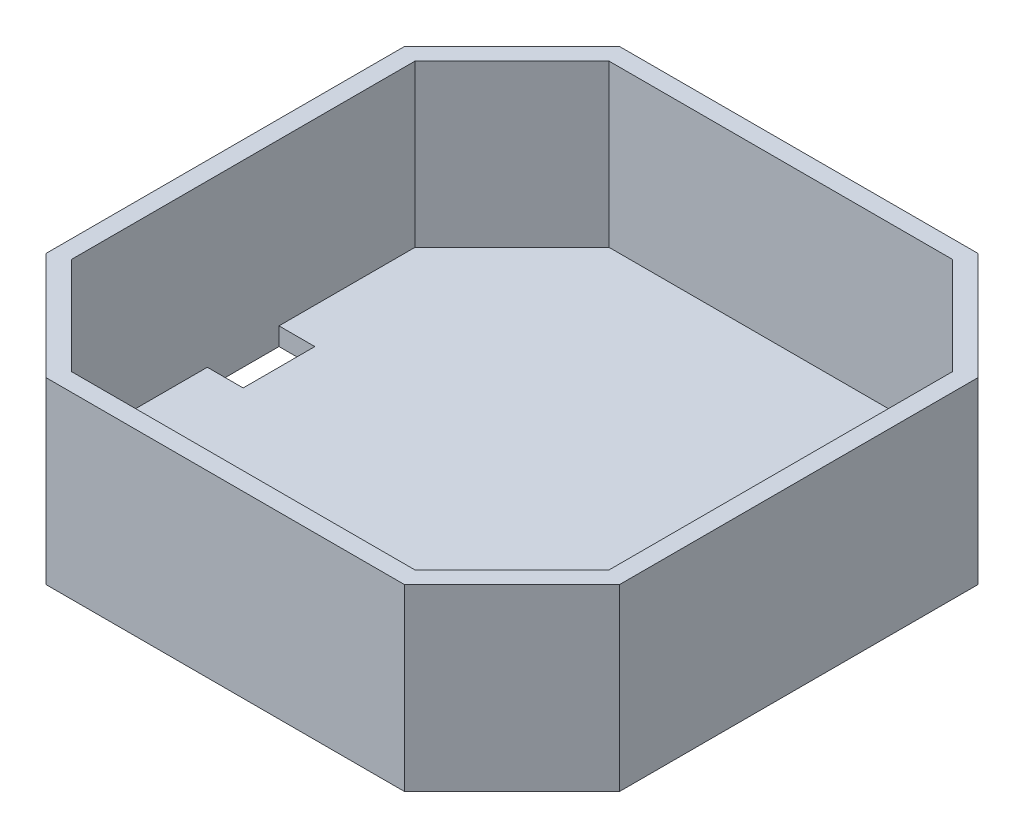
ISO-10303-21;
HEADER;
FILE_DESCRIPTION(('STEP AP214'),'2;1');
FILE_NAME('part.step','',(''),(''),'','','');
FILE_SCHEMA(('AUTOMOTIVE_DESIGN { 1 0 10303 214 1 1 1 1 }'));
ENDSEC;
DATA;
#1=APPLICATION_CONTEXT('core data for automotive mechanical design processes');
#2=APPLICATION_PROTOCOL_DEFINITION('international standard','automotive_design',2000,#1);
#3=PRODUCT_CONTEXT('',#1,'mechanical');
#4=PRODUCT('Part','Part','',(#3));
#5=PRODUCT_RELATED_PRODUCT_CATEGORY('part','',(#4));
#6=PRODUCT_DEFINITION_FORMATION('','',#4);
#7=PRODUCT_DEFINITION_CONTEXT('part definition',#1,'design');
#8=PRODUCT_DEFINITION('design','',#6,#7);
#9=PRODUCT_DEFINITION_SHAPE('','',#8);
#10=(LENGTH_UNIT() NAMED_UNIT(*) SI_UNIT(.MILLI.,.METRE.));
#11=(NAMED_UNIT(*) PLANE_ANGLE_UNIT() SI_UNIT($,.RADIAN.));
#12=(NAMED_UNIT(*) SI_UNIT($,.STERADIAN.) SOLID_ANGLE_UNIT());
#13=UNCERTAINTY_MEASURE_WITH_UNIT(LENGTH_MEASURE(1.E-05),#10,'distance_accuracy_value','');
#14=(GEOMETRIC_REPRESENTATION_CONTEXT(3) GLOBAL_UNCERTAINTY_ASSIGNED_CONTEXT((#13)) GLOBAL_UNIT_ASSIGNED_CONTEXT((#10,
#11,#12)) REPRESENTATION_CONTEXT('',''));
#15=CARTESIAN_POINT('',(0.,0.,0.));
#16=DIRECTION('',(0.,0.,1.));
#17=DIRECTION('',(1.,0.,0.));
#18=AXIS2_PLACEMENT_3D('',#15,#16,#17);
#19=CARTESIAN_POINT('',(0.,50.,0.));
#20=DIRECTION('',(0.,1.,0.));
#21=DIRECTION('',(0.,0.,1.));
#22=AXIS2_PLACEMENT_3D('',#19,#20,#21);
#23=PLANE('',#22);
#24=DIRECTION('',(-0.707106781186551,0.,-0.707106781186544));
#25=VECTOR('',#24,1.);
#26=CARTESIAN_POINT('',(-64.9999999999997,50.,65.0000000000004));
#27=LINE('',#26,#25);
#28=CARTESIAN_POINT('',(-50.,50.,80.));
#29=VERTEX_POINT('',#28);
#30=CARTESIAN_POINT('',(-80.,50.,50.0000000000003));
#31=VERTEX_POINT('',#30);
#32=EDGE_CURVE('E226',#29,#31,#27,.T.);
#33=ORIENTED_EDGE('',*,*,#32,.F.);
#34=DIRECTION('',(1.,0.,0.));
#35=VECTOR('',#34,1.);
#36=CARTESIAN_POINT('',(0.,50.,80.));
#37=LINE('',#36,#35);
#38=CARTESIAN_POINT('',(50.0000000000003,50.,80.));
#39=VERTEX_POINT('',#38);
#40=EDGE_CURVE('E229',#29,#39,#37,.T.);
#41=ORIENTED_EDGE('',*,*,#40,.T.);
#42=DIRECTION('',(-0.707106781186544,0.,0.707106781186551));
#43=VECTOR('',#42,1.);
#44=CARTESIAN_POINT('',(65.0000000000004,50.,64.9999999999997));
#45=LINE('',#44,#43);
#46=CARTESIAN_POINT('',(80.,50.,50.));
#47=VERTEX_POINT('',#46);
#48=EDGE_CURVE('E232',#47,#39,#45,.T.);
#49=ORIENTED_EDGE('',*,*,#48,.F.);
#50=DIRECTION('',(0.,0.,1.));
#51=VECTOR('',#50,1.);
#52=CARTESIAN_POINT('',(80.,50.,0.));
#53=LINE('',#52,#51);
#54=CARTESIAN_POINT('',(80.,50.,-50.0000000000003));
#55=VERTEX_POINT('',#54);
#56=EDGE_CURVE('E235',#55,#47,#53,.T.);
#57=ORIENTED_EDGE('',*,*,#56,.F.);
#58=DIRECTION('',(0.707106781186551,0.,0.707106781186544));
#59=VECTOR('',#58,1.);
#60=CARTESIAN_POINT('',(64.9999999999997,50.,-65.0000000000004));
#61=LINE('',#60,#59);
#62=CARTESIAN_POINT('',(50.,50.,-80.));
#63=VERTEX_POINT('',#62);
#64=EDGE_CURVE('E238',#63,#55,#61,.T.);
#65=ORIENTED_EDGE('',*,*,#64,.F.);
#66=DIRECTION('',(1.,0.,0.));
#67=VECTOR('',#66,1.);
#68=CARTESIAN_POINT('',(0.,50.,-80.));
#69=LINE('',#68,#67);
#70=CARTESIAN_POINT('',(-50.0000000000004,50.,-80.));
#71=VERTEX_POINT('',#70);
#72=EDGE_CURVE('E241',#71,#63,#69,.T.);
#73=ORIENTED_EDGE('',*,*,#72,.F.);
#74=DIRECTION('',(0.707106781186544,0.,-0.707106781186551));
#75=VECTOR('',#74,1.);
#76=CARTESIAN_POINT('',(-65.0000000000004,50.,-64.9999999999997));
#77=LINE('',#76,#75);
#78=CARTESIAN_POINT('',(-80.,50.,-50.));
#79=VERTEX_POINT('',#78);
#80=EDGE_CURVE('E244',#79,#71,#77,.T.);
#81=ORIENTED_EDGE('',*,*,#80,.F.);
#82=DIRECTION('',(0.,0.,1.));
#83=VECTOR('',#82,1.);
#84=CARTESIAN_POINT('',(-80.,50.,0.));
#85=LINE('',#84,#83);
#86=EDGE_CURVE('E247',#79,#31,#85,.T.);
#87=ORIENTED_EDGE('',*,*,#86,.T.);
#88=EDGE_LOOP('',(#33,#41,#49,#57,#65,#73,#81,#87));
#89=FACE_BOUND('',#88,.T.);
#90=DIRECTION('',(1.,0.,0.));
#91=VECTOR('',#90,1.);
#92=CARTESIAN_POINT('',(0.,50.,75.));
#93=LINE('',#92,#91);
#94=CARTESIAN_POINT('',(-47.9289321881345,50.,75.));
#95=VERTEX_POINT('',#94);
#96=CARTESIAN_POINT('',(47.9289321881348,50.,75.));
#97=VERTEX_POINT('',#96);
#98=EDGE_CURVE('E207',#95,#97,#93,.T.);
#99=ORIENTED_EDGE('',*,*,#98,.F.);
#100=DIRECTION('',(-0.707106781186551,0.,-0.707106781186544));
#101=VECTOR('',#100,1.);
#102=CARTESIAN_POINT('',(-61.464466094067,50.,61.4644660940677));
#103=LINE('',#102,#101);
#104=CARTESIAN_POINT('',(-75.,50.,47.9289321881349));
#105=VERTEX_POINT('',#104);
#106=EDGE_CURVE('E198',#95,#105,#103,.T.);
#107=ORIENTED_EDGE('',*,*,#106,.T.);
#108=DIRECTION('',(0.,0.,1.));
#109=VECTOR('',#108,1.);
#110=CARTESIAN_POINT('',(-75.,50.,0.));
#111=LINE('',#110,#109);
#112=CARTESIAN_POINT('',(-75.,50.,-47.9289321881345));
#113=VERTEX_POINT('',#112);
#114=EDGE_CURVE('E224',#113,#105,#111,.T.);
#115=ORIENTED_EDGE('',*,*,#114,.F.);
#116=DIRECTION('',(0.707106781186544,0.,-0.707106781186551));
#117=VECTOR('',#116,1.);
#118=CARTESIAN_POINT('',(-61.4644660940677,50.,-61.464466094067));
#119=LINE('',#118,#117);
#120=CARTESIAN_POINT('',(-47.9289321881349,50.,-75.));
#121=VERTEX_POINT('',#120);
#122=EDGE_CURVE('E221',#113,#121,#119,.T.);
#123=ORIENTED_EDGE('',*,*,#122,.T.);
#124=DIRECTION('',(1.,0.,0.));
#125=VECTOR('',#124,1.);
#126=CARTESIAN_POINT('',(0.,50.,-75.));
#127=LINE('',#126,#125);
#128=CARTESIAN_POINT('',(47.9289321881346,50.,-75.));
#129=VERTEX_POINT('',#128);
#130=EDGE_CURVE('E218',#121,#129,#127,.T.);
#131=ORIENTED_EDGE('',*,*,#130,.T.);
#132=DIRECTION('',(0.707106781186551,0.,0.707106781186544));
#133=VECTOR('',#132,1.);
#134=CARTESIAN_POINT('',(61.464466094067,50.,-61.4644660940677));
#135=LINE('',#134,#133);
#136=CARTESIAN_POINT('',(75.,50.,-47.9289321881349));
#137=VERTEX_POINT('',#136);
#138=EDGE_CURVE('E215',#129,#137,#135,.T.);
#139=ORIENTED_EDGE('',*,*,#138,.T.);
#140=DIRECTION('',(0.,0.,1.));
#141=VECTOR('',#140,1.);
#142=CARTESIAN_POINT('',(75.,50.,0.));
#143=LINE('',#142,#141);
#144=CARTESIAN_POINT('',(75.,50.,47.9289321881345));
#145=VERTEX_POINT('',#144);
#146=EDGE_CURVE('E212',#137,#145,#143,.T.);
#147=ORIENTED_EDGE('',*,*,#146,.T.);
#148=DIRECTION('',(-0.707106781186544,0.,0.707106781186551));
#149=VECTOR('',#148,1.);
#150=CARTESIAN_POINT('',(61.4644660940677,50.,61.464466094067));
#151=LINE('',#150,#149);
#152=EDGE_CURVE('E209',#145,#97,#151,.T.);
#153=ORIENTED_EDGE('',*,*,#152,.T.);
#154=EDGE_LOOP('',(#99,#107,#115,#123,#131,#139,#147,#153));
#155=FACE_BOUND('',#154,.T.);
#156=ADVANCED_FACE('F36',(#89,#155),#23,.T.);
#157=CARTESIAN_POINT('',(-64.9999999999997,50.,65.0000000000004));
#158=DIRECTION('',(-0.707106781186544,0.,0.707106781186551));
#159=DIRECTION('',(0.707106781186551,0.,0.707106781186544));
#160=AXIS2_PLACEMENT_3D('',#157,#158,#159);
#161=PLANE('',#160);
#162=DIRECTION('',(-0.707106781186551,0.,-0.707106781186544));
#163=VECTOR('',#162,1.);
#164=CARTESIAN_POINT('',(-64.9999999999997,0.,65.0000000000004));
#165=LINE('',#164,#163);
#166=CARTESIAN_POINT('',(-50.,0.,80.));
#167=VERTEX_POINT('',#166);
#168=CARTESIAN_POINT('',(-80.,0.,50.0000000000003));
#169=VERTEX_POINT('',#168);
#170=EDGE_CURVE('E250',#167,#169,#165,.T.);
#171=ORIENTED_EDGE('',*,*,#170,.F.);
#172=DIRECTION('',(0.,-1.,0.));
#173=VECTOR('',#172,1.);
#174=CARTESIAN_POINT('',(-50.,50.,80.));
#175=LINE('',#174,#173);
#176=EDGE_CURVE('E11',#29,#167,#175,.T.);
#177=ORIENTED_EDGE('',*,*,#176,.F.);
#178=ORIENTED_EDGE('',*,*,#32,.T.);
#179=DIRECTION('',(0.,-1.,0.));
#180=VECTOR('',#179,1.);
#181=CARTESIAN_POINT('',(-80.,50.,50.0000000000003));
#182=LINE('',#181,#180);
#183=EDGE_CURVE('E249',#31,#169,#182,.T.);
#184=ORIENTED_EDGE('',*,*,#183,.T.);
#185=EDGE_LOOP('',(#171,#177,#178,#184));
#186=FACE_BOUND('',#185,.T.);
#187=ADVANCED_FACE('F38',(#186),#161,.T.);
#188=CARTESIAN_POINT('',(0.,50.,80.));
#189=DIRECTION('',(0.,0.,-1.));
#190=DIRECTION('',(-1.,0.,0.));
#191=AXIS2_PLACEMENT_3D('',#188,#189,#190);
#192=PLANE('',#191);
#193=DIRECTION('',(1.,0.,0.));
#194=VECTOR('',#193,1.);
#195=CARTESIAN_POINT('',(0.,0.,80.));
#196=LINE('',#195,#194);
#197=CARTESIAN_POINT('',(50.0000000000003,0.,80.));
#198=VERTEX_POINT('',#197);
#199=EDGE_CURVE('E253',#167,#198,#196,.T.);
#200=ORIENTED_EDGE('',*,*,#199,.T.);
#201=DIRECTION('',(0.,-1.,0.));
#202=VECTOR('',#201,1.);
#203=CARTESIAN_POINT('',(50.0000000000003,50.,80.));
#204=LINE('',#203,#202);
#205=EDGE_CURVE('E44',#39,#198,#204,.T.);
#206=ORIENTED_EDGE('',*,*,#205,.F.);
#207=ORIENTED_EDGE('',*,*,#40,.F.);
#208=ORIENTED_EDGE('',*,*,#176,.T.);
#209=EDGE_LOOP('',(#200,#206,#207,#208));
#210=FACE_BOUND('',#209,.T.);
#211=ADVANCED_FACE('F292',(#210),#192,.F.);
#212=CARTESIAN_POINT('',(65.0000000000004,50.,64.9999999999997));
#213=DIRECTION('',(0.707106781186551,0.,0.707106781186544));
#214=DIRECTION('',(0.707106781186544,0.,-0.707106781186551));
#215=AXIS2_PLACEMENT_3D('',#212,#213,#214);
#216=PLANE('',#215);
#217=DIRECTION('',(-0.707106781186544,0.,0.707106781186551));
#218=VECTOR('',#217,1.);
#219=CARTESIAN_POINT('',(65.0000000000004,0.,64.9999999999997));
#220=LINE('',#219,#218);
#221=CARTESIAN_POINT('',(80.,0.,50.));
#222=VERTEX_POINT('',#221);
#223=EDGE_CURVE('E257',#222,#198,#220,.T.);
#224=ORIENTED_EDGE('',*,*,#223,.F.);
#225=DIRECTION('',(0.,-1.,0.));
#226=VECTOR('',#225,1.);
#227=CARTESIAN_POINT('',(80.,50.,50.));
#228=LINE('',#227,#226);
#229=EDGE_CURVE('E283',#47,#222,#228,.T.);
#230=ORIENTED_EDGE('',*,*,#229,.F.);
#231=ORIENTED_EDGE('',*,*,#48,.T.);
#232=ORIENTED_EDGE('',*,*,#205,.T.);
#233=EDGE_LOOP('',(#224,#230,#231,#232));
#234=FACE_BOUND('',#233,.T.);
#235=ADVANCED_FACE('F287',(#234),#216,.T.);
#236=CARTESIAN_POINT('',(80.,50.,0.));
#237=DIRECTION('',(1.,0.,0.));
#238=DIRECTION('',(0.,0.,-1.));
#239=AXIS2_PLACEMENT_3D('',#236,#237,#238);
#240=PLANE('',#239);
#241=DIRECTION('',(0.,0.,1.));
#242=VECTOR('',#241,1.);
#243=CARTESIAN_POINT('',(80.,0.,0.));
#244=LINE('',#243,#242);
#245=CARTESIAN_POINT('',(80.,0.,-50.0000000000003));
#246=VERTEX_POINT('',#245);
#247=EDGE_CURVE('E260',#246,#222,#244,.T.);
#248=ORIENTED_EDGE('',*,*,#247,.F.);
#249=DIRECTION('',(0.,-1.,0.));
#250=VECTOR('',#249,1.);
#251=CARTESIAN_POINT('',(80.,50.,-50.0000000000003));
#252=LINE('',#251,#250);
#253=EDGE_CURVE('E281',#55,#246,#252,.T.);
#254=ORIENTED_EDGE('',*,*,#253,.F.);
#255=ORIENTED_EDGE('',*,*,#56,.T.);
#256=ORIENTED_EDGE('',*,*,#229,.T.);
#257=EDGE_LOOP('',(#248,#254,#255,#256));
#258=FACE_BOUND('',#257,.T.);
#259=ADVANCED_FACE('F299',(#258),#240,.T.);
#260=CARTESIAN_POINT('',(64.9999999999997,50.,-65.0000000000004));
#261=DIRECTION('',(0.707106781186544,0.,-0.707106781186551));
#262=DIRECTION('',(-0.707106781186551,0.,-0.707106781186544));
#263=AXIS2_PLACEMENT_3D('',#260,#261,#262);
#264=PLANE('',#263);
#265=DIRECTION('',(0.707106781186551,0.,0.707106781186544));
#266=VECTOR('',#265,1.);
#267=CARTESIAN_POINT('',(64.9999999999997,0.,-65.0000000000004));
#268=LINE('',#267,#266);
#269=CARTESIAN_POINT('',(50.,0.,-80.));
#270=VERTEX_POINT('',#269);
#271=EDGE_CURVE('E263',#270,#246,#268,.T.);
#272=ORIENTED_EDGE('',*,*,#271,.F.);
#273=DIRECTION('',(0.,-1.,0.));
#274=VECTOR('',#273,1.);
#275=CARTESIAN_POINT('',(50.,50.,-80.));
#276=LINE('',#275,#274);
#277=EDGE_CURVE('E279',#63,#270,#276,.T.);
#278=ORIENTED_EDGE('',*,*,#277,.F.);
#279=ORIENTED_EDGE('',*,*,#64,.T.);
#280=ORIENTED_EDGE('',*,*,#253,.T.);
#281=EDGE_LOOP('',(#272,#278,#279,#280));
#282=FACE_BOUND('',#281,.T.);
#283=ADVANCED_FACE('F319',(#282),#264,.T.);
#284=CARTESIAN_POINT('',(0.,50.,-80.));
#285=DIRECTION('',(0.,0.,-1.));
#286=DIRECTION('',(-1.,0.,0.));
#287=AXIS2_PLACEMENT_3D('',#284,#285,#286);
#288=PLANE('',#287);
#289=DIRECTION('',(1.,0.,0.));
#290=VECTOR('',#289,1.);
#291=CARTESIAN_POINT('',(0.,0.,-80.));
#292=LINE('',#291,#290);
#293=CARTESIAN_POINT('',(-50.0000000000004,0.,-80.));
#294=VERTEX_POINT('',#293);
#295=EDGE_CURVE('E266',#294,#270,#292,.T.);
#296=ORIENTED_EDGE('',*,*,#295,.F.);
#297=DIRECTION('',(0.,-1.,0.));
#298=VECTOR('',#297,1.);
#299=CARTESIAN_POINT('',(-50.0000000000004,50.,-80.));
#300=LINE('',#299,#298);
#301=EDGE_CURVE('E277',#71,#294,#300,.T.);
#302=ORIENTED_EDGE('',*,*,#301,.F.);
#303=ORIENTED_EDGE('',*,*,#72,.T.);
#304=ORIENTED_EDGE('',*,*,#277,.T.);
#305=EDGE_LOOP('',(#296,#302,#303,#304));
#306=FACE_BOUND('',#305,.T.);
#307=ADVANCED_FACE('F317',(#306),#288,.T.);
#308=CARTESIAN_POINT('',(-65.0000000000004,50.,-64.9999999999997));
#309=DIRECTION('',(-0.707106781186551,0.,-0.707106781186544));
#310=DIRECTION('',(-0.707106781186544,0.,0.707106781186551));
#311=AXIS2_PLACEMENT_3D('',#308,#309,#310);
#312=PLANE('',#311);
#313=DIRECTION('',(0.707106781186544,0.,-0.707106781186551));
#314=VECTOR('',#313,1.);
#315=CARTESIAN_POINT('',(-65.0000000000004,0.,-64.9999999999997));
#316=LINE('',#315,#314);
#317=CARTESIAN_POINT('',(-80.,0.,-50.));
#318=VERTEX_POINT('',#317);
#319=EDGE_CURVE('E269',#318,#294,#316,.T.);
#320=ORIENTED_EDGE('',*,*,#319,.F.);
#321=DIRECTION('',(0.,-1.,0.));
#322=VECTOR('',#321,1.);
#323=CARTESIAN_POINT('',(-80.,50.,-50.));
#324=LINE('',#323,#322);
#325=EDGE_CURVE('E275',#79,#318,#324,.T.);
#326=ORIENTED_EDGE('',*,*,#325,.F.);
#327=ORIENTED_EDGE('',*,*,#80,.T.);
#328=ORIENTED_EDGE('',*,*,#301,.T.);
#329=EDGE_LOOP('',(#320,#326,#327,#328));
#330=FACE_BOUND('',#329,.T.);
#331=ADVANCED_FACE('F313',(#330),#312,.T.);
#332=CARTESIAN_POINT('',(-80.,50.,0.));
#333=DIRECTION('',(1.,0.,0.));
#334=DIRECTION('',(0.,0.,-1.));
#335=AXIS2_PLACEMENT_3D('',#332,#333,#334);
#336=PLANE('',#335);
#337=DIRECTION('',(0.,0.,1.));
#338=VECTOR('',#337,1.);
#339=CARTESIAN_POINT('',(-80.,0.,0.));
#340=LINE('',#339,#338);
#341=EDGE_CURVE('E230',#318,#169,#340,.T.);
#342=ORIENTED_EDGE('',*,*,#341,.T.);
#343=ORIENTED_EDGE('',*,*,#183,.F.);
#344=ORIENTED_EDGE('',*,*,#86,.F.);
#345=ORIENTED_EDGE('',*,*,#325,.T.);
#346=EDGE_LOOP('',(#342,#343,#344,#345));
#347=FACE_BOUND('',#346,.T.);
#348=ADVANCED_FACE('F339',(#347),#336,.F.);
#349=CARTESIAN_POINT('',(0.,0.,0.));
#350=DIRECTION('',(0.,1.,0.));
#351=DIRECTION('',(0.,0.,1.));
#352=AXIS2_PLACEMENT_3D('',#349,#350,#351);
#353=PLANE('',#352);
#354=DIRECTION('',(1.,0.,0.));
#355=VECTOR('',#354,1.);
#356=CARTESIAN_POINT('',(-75.,0.,-10.));
#357=LINE('',#356,#355);
#358=CARTESIAN_POINT('',(-75.,0.,-10.));
#359=VERTEX_POINT('',#358);
#360=CARTESIAN_POINT('',(-65.,0.,-10.));
#361=VERTEX_POINT('',#360);
#362=EDGE_CURVE('E520',#359,#361,#357,.T.);
#363=ORIENTED_EDGE('',*,*,#362,.F.);
#364=DIRECTION('',(0.,0.,-1.));
#365=VECTOR('',#364,1.);
#366=CARTESIAN_POINT('',(-75.,0.,-10.));
#367=LINE('',#366,#365);
#368=CARTESIAN_POINT('',(-75.,0.,10.));
#369=VERTEX_POINT('',#368);
#370=EDGE_CURVE('E523',#369,#359,#367,.T.);
#371=ORIENTED_EDGE('',*,*,#370,.F.);
#372=DIRECTION('',(-1.,0.,0.));
#373=VECTOR('',#372,1.);
#374=CARTESIAN_POINT('',(-75.,0.,10.));
#375=LINE('',#374,#373);
#376=CARTESIAN_POINT('',(-65.,0.,10.));
#377=VERTEX_POINT('',#376);
#378=EDGE_CURVE('E176',#377,#369,#375,.T.);
#379=ORIENTED_EDGE('',*,*,#378,.F.);
#380=DIRECTION('',(0.,0.,1.));
#381=VECTOR('',#380,1.);
#382=CARTESIAN_POINT('',(-65.,0.,-10.));
#383=LINE('',#382,#381);
#384=EDGE_CURVE('E517',#361,#377,#383,.T.);
#385=ORIENTED_EDGE('',*,*,#384,.F.);
#386=EDGE_LOOP('',(#363,#371,#379,#385));
#387=FACE_BOUND('',#386,.T.);
#388=ORIENTED_EDGE('',*,*,#170,.T.);
#389=ORIENTED_EDGE('',*,*,#341,.F.);
#390=ORIENTED_EDGE('',*,*,#319,.T.);
#391=ORIENTED_EDGE('',*,*,#295,.T.);
#392=ORIENTED_EDGE('',*,*,#271,.T.);
#393=ORIENTED_EDGE('',*,*,#247,.T.);
#394=ORIENTED_EDGE('',*,*,#223,.T.);
#395=ORIENTED_EDGE('',*,*,#199,.F.);
#396=EDGE_LOOP('',(#388,#389,#390,#391,#392,#393,#394,#395));
#397=FACE_BOUND('',#396,.T.);
#398=ADVANCED_FACE('F295',(#387,#397),#353,.F.);
#399=CARTESIAN_POINT('',(-61.464466094067,50.,61.4644660940677));
#400=DIRECTION('',(-0.707106781186544,0.,0.707106781186551));
#401=DIRECTION('',(0.707106781186551,0.,0.707106781186544));
#402=AXIS2_PLACEMENT_3D('',#399,#400,#401);
#403=PLANE('',#402);
#404=DIRECTION('',(-0.707106781186551,0.,-0.707106781186544));
#405=VECTOR('',#404,1.);
#406=CARTESIAN_POINT('',(-61.464466094067,5.,61.4644660940677));
#407=LINE('',#406,#405);
#408=CARTESIAN_POINT('',(-47.9289321881345,5.,75.));
#409=VERTEX_POINT('',#408);
#410=CARTESIAN_POINT('',(-75.,5.,47.9289321881349));
#411=VERTEX_POINT('',#410);
#412=EDGE_CURVE('E524',#409,#411,#407,.T.);
#413=ORIENTED_EDGE('',*,*,#412,.T.);
#414=DIRECTION('',(0.,-1.,0.));
#415=VECTOR('',#414,1.);
#416=CARTESIAN_POINT('',(-75.,50.,47.9289321881348));
#417=LINE('',#416,#415);
#418=EDGE_CURVE('E192',#105,#411,#417,.T.);
#419=ORIENTED_EDGE('',*,*,#418,.F.);
#420=ORIENTED_EDGE('',*,*,#106,.F.);
#421=DIRECTION('',(0.,-1.,0.));
#422=VECTOR('',#421,1.);
#423=CARTESIAN_POINT('',(-47.9289321881345,50.,75.));
#424=LINE('',#423,#422);
#425=EDGE_CURVE('E254',#95,#409,#424,.T.);
#426=ORIENTED_EDGE('',*,*,#425,.T.);
#427=EDGE_LOOP('',(#413,#419,#420,#426));
#428=FACE_BOUND('',#427,.T.);
#429=ADVANCED_FACE('F338',(#428),#403,.F.);
#430=CARTESIAN_POINT('',(0.,50.,75.));
#431=DIRECTION('',(0.,0.,-1.));
#432=DIRECTION('',(-1.,0.,0.));
#433=AXIS2_PLACEMENT_3D('',#430,#431,#432);
#434=PLANE('',#433);
#435=DIRECTION('',(1.,0.,0.));
#436=VECTOR('',#435,1.);
#437=CARTESIAN_POINT('',(0.,5.,75.));
#438=LINE('',#437,#436);
#439=CARTESIAN_POINT('',(47.9289321881348,5.,75.));
#440=VERTEX_POINT('',#439);
#441=EDGE_CURVE('E526',#409,#440,#438,.T.);
#442=ORIENTED_EDGE('',*,*,#441,.F.);
#443=ORIENTED_EDGE('',*,*,#425,.F.);
#444=ORIENTED_EDGE('',*,*,#98,.T.);
#445=DIRECTION('',(0.,-1.,0.));
#446=VECTOR('',#445,1.);
#447=CARTESIAN_POINT('',(47.9289321881348,50.,75.));
#448=LINE('',#447,#446);
#449=EDGE_CURVE('E532',#97,#440,#448,.T.);
#450=ORIENTED_EDGE('',*,*,#449,.T.);
#451=EDGE_LOOP('',(#442,#443,#444,#450));
#452=FACE_BOUND('',#451,.T.);
#453=ADVANCED_FACE('F364',(#452),#434,.T.);
#454=CARTESIAN_POINT('',(61.4644660940677,50.,61.464466094067));
#455=DIRECTION('',(0.707106781186551,0.,0.707106781186544));
#456=DIRECTION('',(0.707106781186544,0.,-0.707106781186551));
#457=AXIS2_PLACEMENT_3D('',#454,#455,#456);
#458=PLANE('',#457);
#459=DIRECTION('',(-0.707106781186544,0.,0.707106781186551));
#460=VECTOR('',#459,1.);
#461=CARTESIAN_POINT('',(61.4644660940677,5.,61.464466094067));
#462=LINE('',#461,#460);
#463=CARTESIAN_POINT('',(75.,5.,47.9289321881345));
#464=VERTEX_POINT('',#463);
#465=EDGE_CURVE('E536',#464,#440,#462,.T.);
#466=ORIENTED_EDGE('',*,*,#465,.T.);
#467=ORIENTED_EDGE('',*,*,#449,.F.);
#468=ORIENTED_EDGE('',*,*,#152,.F.);
#469=DIRECTION('',(0.,-1.,0.));
#470=VECTOR('',#469,1.);
#471=CARTESIAN_POINT('',(75.,50.,47.9289321881345));
#472=LINE('',#471,#470);
#473=EDGE_CURVE('E538',#145,#464,#472,.T.);
#474=ORIENTED_EDGE('',*,*,#473,.T.);
#475=EDGE_LOOP('',(#466,#467,#468,#474));
#476=FACE_BOUND('',#475,.T.);
#477=ADVANCED_FACE('F372',(#476),#458,.F.);
#478=CARTESIAN_POINT('',(75.,50.,0.));
#479=DIRECTION('',(1.,0.,0.));
#480=DIRECTION('',(0.,0.,-1.));
#481=AXIS2_PLACEMENT_3D('',#478,#479,#480);
#482=PLANE('',#481);
#483=DIRECTION('',(0.,0.,1.));
#484=VECTOR('',#483,1.);
#485=CARTESIAN_POINT('',(75.,5.,0.));
#486=LINE('',#485,#484);
#487=CARTESIAN_POINT('',(75.,5.,-47.9289321881349));
#488=VERTEX_POINT('',#487);
#489=EDGE_CURVE('E541',#488,#464,#486,.T.);
#490=ORIENTED_EDGE('',*,*,#489,.T.);
#491=ORIENTED_EDGE('',*,*,#473,.F.);
#492=ORIENTED_EDGE('',*,*,#146,.F.);
#493=DIRECTION('',(0.,-1.,0.));
#494=VECTOR('',#493,1.);
#495=CARTESIAN_POINT('',(75.,50.,-47.9289321881349));
#496=LINE('',#495,#494);
#497=EDGE_CURVE('E543',#137,#488,#496,.T.);
#498=ORIENTED_EDGE('',*,*,#497,.T.);
#499=EDGE_LOOP('',(#490,#491,#492,#498));
#500=FACE_BOUND('',#499,.T.);
#501=ADVANCED_FACE('F380',(#500),#482,.F.);
#502=CARTESIAN_POINT('',(61.464466094067,50.,-61.4644660940677));
#503=DIRECTION('',(0.707106781186544,0.,-0.707106781186551));
#504=DIRECTION('',(-0.707106781186551,0.,-0.707106781186544));
#505=AXIS2_PLACEMENT_3D('',#502,#503,#504);
#506=PLANE('',#505);
#507=DIRECTION('',(0.707106781186551,0.,0.707106781186544));
#508=VECTOR('',#507,1.);
#509=CARTESIAN_POINT('',(61.464466094067,5.,-61.4644660940677));
#510=LINE('',#509,#508);
#511=CARTESIAN_POINT('',(47.9289321881346,5.,-75.));
#512=VERTEX_POINT('',#511);
#513=EDGE_CURVE('E546',#512,#488,#510,.T.);
#514=ORIENTED_EDGE('',*,*,#513,.T.);
#515=ORIENTED_EDGE('',*,*,#497,.F.);
#516=ORIENTED_EDGE('',*,*,#138,.F.);
#517=DIRECTION('',(0.,-1.,0.));
#518=VECTOR('',#517,1.);
#519=CARTESIAN_POINT('',(47.9289321881346,50.,-75.));
#520=LINE('',#519,#518);
#521=EDGE_CURVE('E548',#129,#512,#520,.T.);
#522=ORIENTED_EDGE('',*,*,#521,.T.);
#523=EDGE_LOOP('',(#514,#515,#516,#522));
#524=FACE_BOUND('',#523,.T.);
#525=ADVANCED_FACE('F388',(#524),#506,.F.);
#526=CARTESIAN_POINT('',(0.,50.,-75.));
#527=DIRECTION('',(0.,0.,-1.));
#528=DIRECTION('',(-1.,0.,0.));
#529=AXIS2_PLACEMENT_3D('',#526,#527,#528);
#530=PLANE('',#529);
#531=DIRECTION('',(1.,0.,0.));
#532=VECTOR('',#531,1.);
#533=CARTESIAN_POINT('',(0.,5.,-75.));
#534=LINE('',#533,#532);
#535=CARTESIAN_POINT('',(-47.9289321881349,5.,-75.));
#536=VERTEX_POINT('',#535);
#537=EDGE_CURVE('E200',#536,#512,#534,.T.);
#538=ORIENTED_EDGE('',*,*,#537,.T.);
#539=ORIENTED_EDGE('',*,*,#521,.F.);
#540=ORIENTED_EDGE('',*,*,#130,.F.);
#541=DIRECTION('',(0.,-1.,0.));
#542=VECTOR('',#541,1.);
#543=CARTESIAN_POINT('',(-47.9289321881349,50.,-75.));
#544=LINE('',#543,#542);
#545=EDGE_CURVE('E552',#121,#536,#544,.T.);
#546=ORIENTED_EDGE('',*,*,#545,.T.);
#547=EDGE_LOOP('',(#538,#539,#540,#546));
#548=FACE_BOUND('',#547,.T.);
#549=ADVANCED_FACE('F396',(#548),#530,.F.);
#550=CARTESIAN_POINT('',(-61.4644660940677,50.,-61.464466094067));
#551=DIRECTION('',(-0.707106781186551,0.,-0.707106781186544));
#552=DIRECTION('',(-0.707106781186544,0.,0.707106781186551));
#553=AXIS2_PLACEMENT_3D('',#550,#551,#552);
#554=PLANE('',#553);
#555=DIRECTION('',(0.707106781186544,0.,-0.707106781186551));
#556=VECTOR('',#555,1.);
#557=CARTESIAN_POINT('',(-61.4644660940677,5.,-61.464466094067));
#558=LINE('',#557,#556);
#559=CARTESIAN_POINT('',(-75.,5.,-47.9289321881345));
#560=VERTEX_POINT('',#559);
#561=EDGE_CURVE('E195',#560,#536,#558,.T.);
#562=ORIENTED_EDGE('',*,*,#561,.T.);
#563=ORIENTED_EDGE('',*,*,#545,.F.);
#564=ORIENTED_EDGE('',*,*,#122,.F.);
#565=DIRECTION('',(0.,-1.,0.));
#566=VECTOR('',#565,1.);
#567=CARTESIAN_POINT('',(-75.,50.,-47.9289321881345));
#568=LINE('',#567,#566);
#569=EDGE_CURVE('E204',#113,#560,#568,.T.);
#570=ORIENTED_EDGE('',*,*,#569,.T.);
#571=EDGE_LOOP('',(#562,#563,#564,#570));
#572=FACE_BOUND('',#571,.T.);
#573=ADVANCED_FACE('F404',(#572),#554,.F.);
#574=CARTESIAN_POINT('',(-75.,50.,0.));
#575=DIRECTION('',(1.,0.,0.));
#576=DIRECTION('',(0.,0.,-1.));
#577=AXIS2_PLACEMENT_3D('',#574,#575,#576);
#578=PLANE('',#577);
#579=DIRECTION('',(0.,0.,1.));
#580=VECTOR('',#579,1.);
#581=CARTESIAN_POINT('',(-75.,5.,0.));
#582=LINE('',#581,#580);
#583=CARTESIAN_POINT('',(-75.,5.,-10.));
#584=VERTEX_POINT('',#583);
#585=EDGE_CURVE('E194',#560,#584,#582,.T.);
#586=ORIENTED_EDGE('',*,*,#585,.F.);
#587=ORIENTED_EDGE('',*,*,#569,.F.);
#588=ORIENTED_EDGE('',*,*,#114,.T.);
#589=ORIENTED_EDGE('',*,*,#418,.T.);
#590=CARTESIAN_POINT('',(-75.,5.,10.));
#591=VERTEX_POINT('',#590);
#592=EDGE_CURVE('E185',#591,#411,#582,.T.);
#593=ORIENTED_EDGE('',*,*,#592,.F.);
#594=DIRECTION('',(0.,1.,0.));
#595=VECTOR('',#594,1.);
#596=CARTESIAN_POINT('',(-75.,-22.3606797749979,10.));
#597=LINE('',#596,#595);
#598=EDGE_CURVE('E171',#369,#591,#597,.T.);
#599=ORIENTED_EDGE('',*,*,#598,.F.);
#600=ORIENTED_EDGE('',*,*,#370,.T.);
#601=DIRECTION('',(0.,1.,0.));
#602=VECTOR('',#601,1.);
#603=CARTESIAN_POINT('',(-75.,-22.3606797749979,-10.));
#604=LINE('',#603,#602);
#605=EDGE_CURVE('E521',#359,#584,#604,.T.);
#606=ORIENTED_EDGE('',*,*,#605,.T.);
#607=EDGE_LOOP('',(#586,#587,#588,#589,#593,#599,#600,#606));
#608=FACE_BOUND('',#607,.T.);
#609=ADVANCED_FACE('F190',(#608),#578,.T.);
#610=CARTESIAN_POINT('',(0.,5.,0.));
#611=DIRECTION('',(0.,1.,0.));
#612=DIRECTION('',(0.,0.,1.));
#613=AXIS2_PLACEMENT_3D('',#610,#611,#612);
#614=PLANE('',#613);
#615=DIRECTION('',(1.,0.,0.));
#616=VECTOR('',#615,1.);
#617=CARTESIAN_POINT('',(-75.,5.,10.));
#618=LINE('',#617,#616);
#619=CARTESIAN_POINT('',(-65.,5.,10.));
#620=VERTEX_POINT('',#619);
#621=EDGE_CURVE('E174',#591,#620,#618,.T.);
#622=ORIENTED_EDGE('',*,*,#621,.F.);
#623=ORIENTED_EDGE('',*,*,#592,.T.);
#624=ORIENTED_EDGE('',*,*,#412,.F.);
#625=ORIENTED_EDGE('',*,*,#441,.T.);
#626=ORIENTED_EDGE('',*,*,#465,.F.);
#627=ORIENTED_EDGE('',*,*,#489,.F.);
#628=ORIENTED_EDGE('',*,*,#513,.F.);
#629=ORIENTED_EDGE('',*,*,#537,.F.);
#630=ORIENTED_EDGE('',*,*,#561,.F.);
#631=ORIENTED_EDGE('',*,*,#585,.T.);
#632=DIRECTION('',(-1.,0.,0.));
#633=VECTOR('',#632,1.);
#634=CARTESIAN_POINT('',(-75.,5.,-10.));
#635=LINE('',#634,#633);
#636=CARTESIAN_POINT('',(-65.,5.,-10.));
#637=VERTEX_POINT('',#636);
#638=EDGE_CURVE('E180',#637,#584,#635,.T.);
#639=ORIENTED_EDGE('',*,*,#638,.F.);
#640=DIRECTION('',(0.,0.,-1.));
#641=VECTOR('',#640,1.);
#642=CARTESIAN_POINT('',(-65.,5.,-10.));
#643=LINE('',#642,#641);
#644=EDGE_CURVE('E51',#620,#637,#643,.T.);
#645=ORIENTED_EDGE('',*,*,#644,.F.);
#646=EDGE_LOOP('',(#622,#623,#624,#625,#626,#627,#628,#629,#630,#631,#639,#645));
#647=FACE_BOUND('',#646,.T.);
#648=ADVANCED_FACE('F183',(#647),#614,.T.);
#649=CARTESIAN_POINT('',(-75.,-22.3606797749979,-10.));
#650=DIRECTION('',(0.,0.,-1.));
#651=DIRECTION('',(-1.,0.,0.));
#652=AXIS2_PLACEMENT_3D('',#649,#650,#651);
#653=PLANE('',#652);
#654=ORIENTED_EDGE('',*,*,#362,.T.);
#655=DIRECTION('',(0.,1.,0.));
#656=VECTOR('',#655,1.);
#657=CARTESIAN_POINT('',(-65.,-22.3606797749979,-10.));
#658=LINE('',#657,#656);
#659=EDGE_CURVE('E518',#361,#637,#658,.T.);
#660=ORIENTED_EDGE('',*,*,#659,.T.);
#661=ORIENTED_EDGE('',*,*,#638,.T.);
#662=ORIENTED_EDGE('',*,*,#605,.F.);
#663=EDGE_LOOP('',(#654,#660,#661,#662));
#664=FACE_BOUND('',#663,.T.);
#665=ADVANCED_FACE('F422',(#664),#653,.F.);
#666=CARTESIAN_POINT('',(-65.,-22.3606797749979,-10.));
#667=DIRECTION('',(1.,0.,0.));
#668=DIRECTION('',(0.,0.,-1.));
#669=AXIS2_PLACEMENT_3D('',#666,#667,#668);
#670=PLANE('',#669);
#671=ORIENTED_EDGE('',*,*,#384,.T.);
#672=DIRECTION('',(0.,1.,0.));
#673=VECTOR('',#672,1.);
#674=CARTESIAN_POINT('',(-65.,-22.3606797749979,10.));
#675=LINE('',#674,#673);
#676=EDGE_CURVE('E58',#377,#620,#675,.T.);
#677=ORIENTED_EDGE('',*,*,#676,.T.);
#678=ORIENTED_EDGE('',*,*,#644,.T.);
#679=ORIENTED_EDGE('',*,*,#659,.F.);
#680=EDGE_LOOP('',(#671,#677,#678,#679));
#681=FACE_BOUND('',#680,.T.);
#682=ADVANCED_FACE('F428',(#681),#670,.F.);
#683=CARTESIAN_POINT('',(-75.,-22.3606797749979,10.));
#684=DIRECTION('',(0.,0.,1.));
#685=DIRECTION('',(1.,0.,0.));
#686=AXIS2_PLACEMENT_3D('',#683,#684,#685);
#687=PLANE('',#686);
#688=ORIENTED_EDGE('',*,*,#378,.T.);
#689=ORIENTED_EDGE('',*,*,#598,.T.);
#690=ORIENTED_EDGE('',*,*,#621,.T.);
#691=ORIENTED_EDGE('',*,*,#676,.F.);
#692=EDGE_LOOP('',(#688,#689,#690,#691));
#693=FACE_BOUND('',#692,.T.);
#694=ADVANCED_FACE('F173',(#693),#687,.F.);
#695=CLOSED_SHELL('',(#156,#187,#211,#235,#259,#283,#307,#331,#348,#398,#429,#453,#477,#501,
#525,#549,#573,#609,#648,#665,#682,#694));
#696=MANIFOLD_SOLID_BREP('B2',#695);
#697=ADVANCED_BREP_SHAPE_REPRESENTATION('',(#18,#696),#14);
#698=SHAPE_DEFINITION_REPRESENTATION(#9,#697);
ENDSEC;
END-ISO-10303-21;
